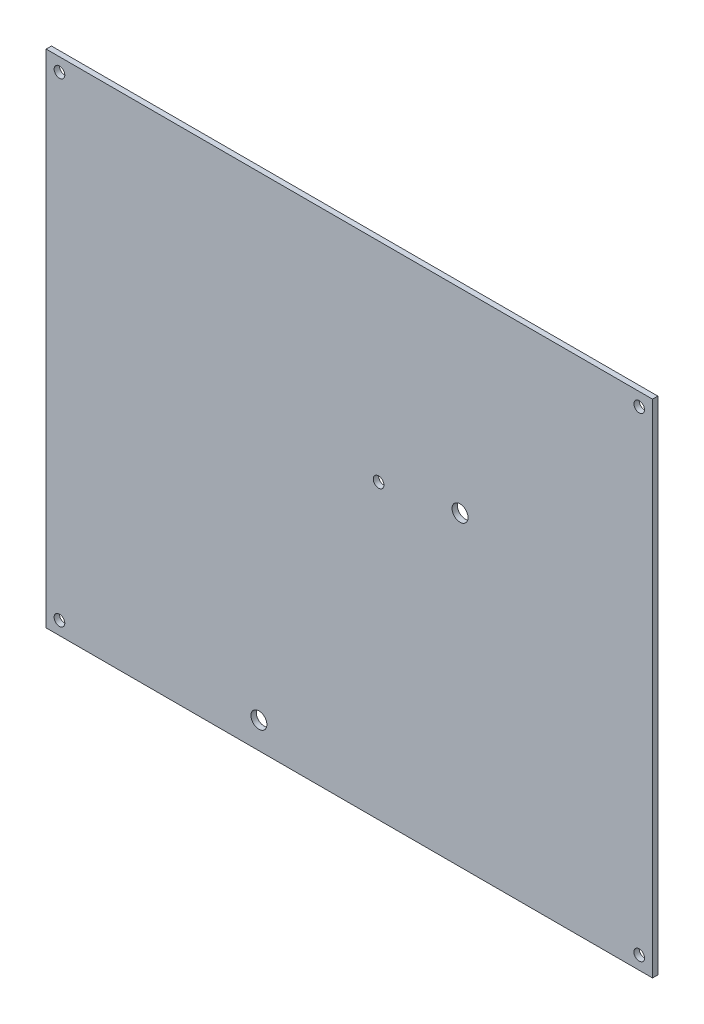
ISO-10303-21;
HEADER;
FILE_DESCRIPTION(('STEP AP214'),'2;1');
FILE_NAME('part.step','',(''),(''),'','','');
FILE_SCHEMA(('AUTOMOTIVE_DESIGN { 1 0 10303 214 1 1 1 1 }'));
ENDSEC;
DATA;
#1=APPLICATION_CONTEXT('core data for automotive mechanical design processes');
#2=APPLICATION_PROTOCOL_DEFINITION('international standard','automotive_design',2000,#1);
#3=PRODUCT_CONTEXT('',#1,'mechanical');
#4=PRODUCT('Part','Part','',(#3));
#5=PRODUCT_RELATED_PRODUCT_CATEGORY('part','',(#4));
#6=PRODUCT_DEFINITION_FORMATION('','',#4);
#7=PRODUCT_DEFINITION_CONTEXT('part definition',#1,'design');
#8=PRODUCT_DEFINITION('design','',#6,#7);
#9=PRODUCT_DEFINITION_SHAPE('','',#8);
#10=(LENGTH_UNIT() NAMED_UNIT(*) SI_UNIT(.MILLI.,.METRE.));
#11=(NAMED_UNIT(*) PLANE_ANGLE_UNIT() SI_UNIT($,.RADIAN.));
#12=(NAMED_UNIT(*) SI_UNIT($,.STERADIAN.) SOLID_ANGLE_UNIT());
#13=UNCERTAINTY_MEASURE_WITH_UNIT(LENGTH_MEASURE(1.E-05),#10,'distance_accuracy_value','');
#14=(GEOMETRIC_REPRESENTATION_CONTEXT(3) GLOBAL_UNCERTAINTY_ASSIGNED_CONTEXT((#13)) GLOBAL_UNIT_ASSIGNED_CONTEXT((#10,
#11,#12)) REPRESENTATION_CONTEXT('',''));
#15=CARTESIAN_POINT('',(0.,0.,0.));
#16=DIRECTION('',(0.,0.,1.));
#17=DIRECTION('',(1.,0.,0.));
#18=AXIS2_PLACEMENT_3D('',#15,#16,#17);
#19=CARTESIAN_POINT('',(30.2454837382941,63.3993055555556,1.));
#20=DIRECTION('',(-1.,0.,0.));
#21=DIRECTION('',(0.,-1.,0.));
#22=AXIS2_PLACEMENT_3D('',#19,#20,#21);
#23=PLANE('',#22);
#24=DIRECTION('',(0.,1.,0.));
#25=VECTOR('',#24,1.);
#26=CARTESIAN_POINT('',(30.2454837382941,63.3993055555556,0.));
#27=LINE('',#26,#25);
#28=CARTESIAN_POINT('',(30.2454837382941,-46.6006944444448,0.));
#29=VERTEX_POINT('',#28);
#30=CARTESIAN_POINT('',(30.2454837382941,47.6493055555556,0.));
#31=VERTEX_POINT('',#30);
#32=EDGE_CURVE('E97',#29,#31,#27,.T.);
#33=ORIENTED_EDGE('',*,*,#32,.T.);
#34=DIRECTION('',(0.,0.,1.));
#35=VECTOR('',#34,1.);
#36=CARTESIAN_POINT('',(30.2454837382941,47.6493055555556,0.));
#37=LINE('',#36,#35);
#38=CARTESIAN_POINT('',(30.2454837382941,47.6493055555556,1.));
#39=VERTEX_POINT('',#38);
#40=EDGE_CURVE('E62',#31,#39,#37,.T.);
#41=ORIENTED_EDGE('',*,*,#40,.T.);
#42=DIRECTION('',(0.,1.,0.));
#43=VECTOR('',#42,1.);
#44=CARTESIAN_POINT('',(30.2454837382941,63.3993055555556,1.));
#45=LINE('',#44,#43);
#46=CARTESIAN_POINT('',(30.2454837382941,-46.6006944444448,1.));
#47=VERTEX_POINT('',#46);
#48=EDGE_CURVE('E92',#47,#39,#45,.T.);
#49=ORIENTED_EDGE('',*,*,#48,.F.);
#50=DIRECTION('',(0.,0.,-1.));
#51=VECTOR('',#50,1.);
#52=CARTESIAN_POINT('',(30.2454837382941,-46.6006944444448,1.));
#53=LINE('',#52,#51);
#54=EDGE_CURVE('E54',#47,#29,#53,.T.);
#55=ORIENTED_EDGE('',*,*,#54,.T.);
#56=EDGE_LOOP('',(#33,#41,#49,#55));
#57=FACE_BOUND('',#56,.T.);
#58=ADVANCED_FACE('F45',(#57),#23,.F.);
#59=CARTESIAN_POINT('',(-83.7545162617059,63.3993055555556,1.));
#60=DIRECTION('',(1.,0.,0.));
#61=DIRECTION('',(0.,1.,0.));
#62=AXIS2_PLACEMENT_3D('',#59,#60,#61);
#63=PLANE('',#62);
#64=DIRECTION('',(0.,-1.,0.));
#65=VECTOR('',#64,1.);
#66=CARTESIAN_POINT('',(-83.7545162617059,63.3993055555556,1.));
#67=LINE('',#66,#65);
#68=CARTESIAN_POINT('',(-83.7545162617059,47.6493055555556,1.));
#69=VERTEX_POINT('',#68);
#70=CARTESIAN_POINT('',(-83.7545162617059,-46.6006944444448,1.));
#71=VERTEX_POINT('',#70);
#72=EDGE_CURVE('E150',#69,#71,#67,.T.);
#73=ORIENTED_EDGE('',*,*,#72,.F.);
#74=DIRECTION('',(0.,0.,1.));
#75=VECTOR('',#74,1.);
#76=CARTESIAN_POINT('',(-83.7545162617059,47.6493055555556,0.));
#77=LINE('',#76,#75);
#78=CARTESIAN_POINT('',(-83.7545162617059,47.6493055555556,0.));
#79=VERTEX_POINT('',#78);
#80=EDGE_CURVE('E163',#79,#69,#77,.T.);
#81=ORIENTED_EDGE('',*,*,#80,.F.);
#82=DIRECTION('',(0.,-1.,0.));
#83=VECTOR('',#82,1.);
#84=CARTESIAN_POINT('',(-83.7545162617059,63.3993055555556,0.));
#85=LINE('',#84,#83);
#86=CARTESIAN_POINT('',(-83.7545162617059,-46.6006944444448,0.));
#87=VERTEX_POINT('',#86);
#88=EDGE_CURVE('E93',#79,#87,#85,.T.);
#89=ORIENTED_EDGE('',*,*,#88,.T.);
#90=DIRECTION('',(0.,0.,-1.));
#91=VECTOR('',#90,1.);
#92=CARTESIAN_POINT('',(-83.7545162617059,-46.6006944444448,1.));
#93=LINE('',#92,#91);
#94=EDGE_CURVE('E11',#71,#87,#93,.T.);
#95=ORIENTED_EDGE('',*,*,#94,.F.);
#96=EDGE_LOOP('',(#73,#81,#89,#95));
#97=FACE_BOUND('',#96,.T.);
#98=ADVANCED_FACE('F161',(#97),#63,.F.);
#99=CARTESIAN_POINT('',(-83.7545162617059,-46.6006944444448,1.));
#100=DIRECTION('',(0.,1.,0.));
#101=DIRECTION('',(0.,0.,1.));
#102=AXIS2_PLACEMENT_3D('',#99,#100,#101);
#103=PLANE('',#102);
#104=DIRECTION('',(1.,0.,0.));
#105=VECTOR('',#104,1.);
#106=CARTESIAN_POINT('',(-83.7545162617059,-46.6006944444448,0.));
#107=LINE('',#106,#105);
#108=EDGE_CURVE('E83',#87,#29,#107,.T.);
#109=ORIENTED_EDGE('',*,*,#108,.T.);
#110=ORIENTED_EDGE('',*,*,#54,.F.);
#111=DIRECTION('',(1.,0.,0.));
#112=VECTOR('',#111,1.);
#113=CARTESIAN_POINT('',(-83.7545162617059,-46.6006944444448,1.));
#114=LINE('',#113,#112);
#115=EDGE_CURVE('E71',#71,#47,#114,.T.);
#116=ORIENTED_EDGE('',*,*,#115,.F.);
#117=ORIENTED_EDGE('',*,*,#94,.T.);
#118=EDGE_LOOP('',(#109,#110,#116,#117));
#119=FACE_BOUND('',#118,.T.);
#120=ADVANCED_FACE('F85',(#119),#103,.F.);
#121=CARTESIAN_POINT('',(0.,0.,1.));
#122=DIRECTION('',(0.,0.,1.));
#123=DIRECTION('',(1.,0.,0.));
#124=AXIS2_PLACEMENT_3D('',#121,#122,#123);
#125=PLANE('',#124);
#126=DIRECTION('',(1.,0.,0.));
#127=VECTOR('',#126,1.);
#128=CARTESIAN_POINT('',(-83.7545162617059,47.6493055555556,1.));
#129=LINE('',#128,#127);
#130=EDGE_CURVE('E158',#69,#39,#129,.T.);
#131=ORIENTED_EDGE('',*,*,#130,.F.);
#132=ORIENTED_EDGE('',*,*,#72,.T.);
#133=ORIENTED_EDGE('',*,*,#115,.T.);
#134=ORIENTED_EDGE('',*,*,#48,.T.);
#135=EDGE_LOOP('',(#131,#132,#133,#134));
#136=FACE_BOUND('',#135,.T.);
#137=CARTESIAN_POINT('',(27.7454837382941,45.1493055555556,1.));
#138=DIRECTION('',(0.,0.,1.));
#139=DIRECTION('',(1.,0.,0.));
#140=AXIS2_PLACEMENT_3D('',#137,#138,#139);
#141=CIRCLE('',#140,1.);
#142=CARTESIAN_POINT('',(28.7454837382941,45.1493055555556,1.));
#143=VERTEX_POINT('',#142);
#144=EDGE_CURVE('E172',#143,#143,#141,.T.);
#145=ORIENTED_EDGE('',*,*,#144,.F.);
#146=EDGE_LOOP('',(#145));
#147=FACE_BOUND('',#146,.T.);
#148=CARTESIAN_POINT('',(-81.2545162617059,45.1493055555556,1.));
#149=DIRECTION('',(0.,0.,1.));
#150=DIRECTION('',(1.,0.,0.));
#151=AXIS2_PLACEMENT_3D('',#148,#149,#150);
#152=CIRCLE('',#151,0.999999999999998);
#153=CARTESIAN_POINT('',(-80.2545162617059,45.1493055555556,1.));
#154=VERTEX_POINT('',#153);
#155=EDGE_CURVE('E181',#154,#154,#152,.T.);
#156=ORIENTED_EDGE('',*,*,#155,.F.);
#157=EDGE_LOOP('',(#156));
#158=FACE_BOUND('',#157,.T.);
#159=CARTESIAN_POINT('',(-5.9445162617059,11.0093055555552,1.));
#160=DIRECTION('',(0.,0.,1.));
#161=DIRECTION('',(1.,0.,0.));
#162=AXIS2_PLACEMENT_3D('',#159,#160,#161);
#163=CIRCLE('',#162,1.5);
#164=CARTESIAN_POINT('',(-4.4445162617059,11.0093055555552,1.));
#165=VERTEX_POINT('',#164);
#166=EDGE_CURVE('E135',#165,#165,#163,.T.);
#167=ORIENTED_EDGE('',*,*,#166,.F.);
#168=EDGE_LOOP('',(#167));
#169=FACE_BOUND('',#168,.T.);
#170=CARTESIAN_POINT('',(-43.7545162617059,-41.6006944444448,1.));
#171=DIRECTION('',(0.,0.,1.));
#172=DIRECTION('',(1.,0.,0.));
#173=AXIS2_PLACEMENT_3D('',#170,#171,#172);
#174=CIRCLE('',#173,1.5);
#175=CARTESIAN_POINT('',(-42.2545162617059,-41.6006944444448,1.));
#176=VERTEX_POINT('',#175);
#177=EDGE_CURVE('E122',#176,#176,#174,.T.);
#178=ORIENTED_EDGE('',*,*,#177,.F.);
#179=EDGE_LOOP('',(#178));
#180=FACE_BOUND('',#179,.T.);
#181=CARTESIAN_POINT('',(-21.2545162617059,8.39930555555517,1.));
#182=DIRECTION('',(0.,0.,1.));
#183=DIRECTION('',(1.,0.,0.));
#184=AXIS2_PLACEMENT_3D('',#181,#182,#183);
#185=CIRCLE('',#184,1.);
#186=CARTESIAN_POINT('',(-20.2545162617059,8.39930555555517,1.));
#187=VERTEX_POINT('',#186);
#188=EDGE_CURVE('E118',#187,#187,#185,.T.);
#189=ORIENTED_EDGE('',*,*,#188,.F.);
#190=EDGE_LOOP('',(#189));
#191=FACE_BOUND('',#190,.T.);
#192=CARTESIAN_POINT('',(-81.2545162617059,-44.1006944444448,1.));
#193=DIRECTION('',(0.,0.,1.));
#194=DIRECTION('',(1.,0.,0.));
#195=AXIS2_PLACEMENT_3D('',#192,#193,#194);
#196=CIRCLE('',#195,0.999999999999998);
#197=CARTESIAN_POINT('',(-80.2545162617059,-44.1006944444448,1.));
#198=VERTEX_POINT('',#197);
#199=EDGE_CURVE('E142',#198,#198,#196,.T.);
#200=ORIENTED_EDGE('',*,*,#199,.F.);
#201=EDGE_LOOP('',(#200));
#202=FACE_BOUND('',#201,.T.);
#203=CARTESIAN_POINT('',(27.7454837382941,-44.1006944444448,1.));
#204=DIRECTION('',(0.,0.,1.));
#205=DIRECTION('',(1.,0.,0.));
#206=AXIS2_PLACEMENT_3D('',#203,#204,#205);
#207=CIRCLE('',#206,1.);
#208=CARTESIAN_POINT('',(28.7454837382941,-44.1006944444448,1.));
#209=VERTEX_POINT('',#208);
#210=EDGE_CURVE('E103',#209,#209,#207,.T.);
#211=ORIENTED_EDGE('',*,*,#210,.F.);
#212=EDGE_LOOP('',(#211));
#213=FACE_BOUND('',#212,.T.);
#214=ADVANCED_FACE('F155',(#136,#147,#158,#169,#180,#191,#202,#213),#125,.T.);
#215=CARTESIAN_POINT('',(0.,0.,0.));
#216=DIRECTION('',(0.,0.,1.));
#217=DIRECTION('',(1.,0.,0.));
#218=AXIS2_PLACEMENT_3D('',#215,#216,#217);
#219=PLANE('',#218);
#220=CARTESIAN_POINT('',(27.7454837382941,45.1493055555556,0.));
#221=DIRECTION('',(0.,0.,1.));
#222=DIRECTION('',(1.,0.,0.));
#223=AXIS2_PLACEMENT_3D('',#220,#221,#222);
#224=CIRCLE('',#223,1.);
#225=CARTESIAN_POINT('',(28.7454837382941,45.1493055555556,0.));
#226=VERTEX_POINT('',#225);
#227=EDGE_CURVE('E177',#226,#226,#224,.T.);
#228=ORIENTED_EDGE('',*,*,#227,.T.);
#229=EDGE_LOOP('',(#228));
#230=FACE_BOUND('',#229,.T.);
#231=CARTESIAN_POINT('',(-81.2545162617059,45.1493055555556,0.));
#232=DIRECTION('',(0.,0.,1.));
#233=DIRECTION('',(1.,0.,0.));
#234=AXIS2_PLACEMENT_3D('',#231,#232,#233);
#235=CIRCLE('',#234,0.999999999999998);
#236=CARTESIAN_POINT('',(-80.2545162617059,45.1493055555556,0.));
#237=VERTEX_POINT('',#236);
#238=EDGE_CURVE('E185',#237,#237,#235,.T.);
#239=ORIENTED_EDGE('',*,*,#238,.T.);
#240=EDGE_LOOP('',(#239));
#241=FACE_BOUND('',#240,.T.);
#242=CARTESIAN_POINT('',(-5.9445162617059,11.0093055555552,0.));
#243=DIRECTION('',(0.,0.,1.));
#244=DIRECTION('',(1.,0.,0.));
#245=AXIS2_PLACEMENT_3D('',#242,#243,#244);
#246=CIRCLE('',#245,1.5);
#247=CARTESIAN_POINT('',(-4.4445162617059,11.0093055555552,0.));
#248=VERTEX_POINT('',#247);
#249=EDGE_CURVE('E48',#248,#248,#246,.T.);
#250=ORIENTED_EDGE('',*,*,#249,.T.);
#251=EDGE_LOOP('',(#250));
#252=FACE_BOUND('',#251,.T.);
#253=CARTESIAN_POINT('',(-43.7545162617059,-41.6006944444448,0.));
#254=DIRECTION('',(0.,0.,1.));
#255=DIRECTION('',(1.,0.,0.));
#256=AXIS2_PLACEMENT_3D('',#253,#254,#255);
#257=CIRCLE('',#256,1.5);
#258=CARTESIAN_POINT('',(-42.2545162617059,-41.6006944444448,0.));
#259=VERTEX_POINT('',#258);
#260=EDGE_CURVE('E119',#259,#259,#257,.T.);
#261=ORIENTED_EDGE('',*,*,#260,.T.);
#262=EDGE_LOOP('',(#261));
#263=FACE_BOUND('',#262,.T.);
#264=CARTESIAN_POINT('',(-21.2545162617059,8.39930555555517,0.));
#265=DIRECTION('',(0.,0.,1.));
#266=DIRECTION('',(1.,0.,0.));
#267=AXIS2_PLACEMENT_3D('',#264,#265,#266);
#268=CIRCLE('',#267,1.);
#269=CARTESIAN_POINT('',(-20.2545162617059,8.39930555555517,0.));
#270=VERTEX_POINT('',#269);
#271=EDGE_CURVE('E114',#270,#270,#268,.T.);
#272=ORIENTED_EDGE('',*,*,#271,.T.);
#273=EDGE_LOOP('',(#272));
#274=FACE_BOUND('',#273,.T.);
#275=CARTESIAN_POINT('',(-81.2545162617059,-44.1006944444448,0.));
#276=DIRECTION('',(0.,0.,1.));
#277=DIRECTION('',(1.,0.,0.));
#278=AXIS2_PLACEMENT_3D('',#275,#276,#277);
#279=CIRCLE('',#278,0.999999999999998);
#280=CARTESIAN_POINT('',(-80.2545162617059,-44.1006944444448,0.));
#281=VERTEX_POINT('',#280);
#282=EDGE_CURVE('E117',#281,#281,#279,.T.);
#283=ORIENTED_EDGE('',*,*,#282,.T.);
#284=EDGE_LOOP('',(#283));
#285=FACE_BOUND('',#284,.T.);
#286=CARTESIAN_POINT('',(27.7454837382941,-44.1006944444448,0.));
#287=DIRECTION('',(0.,0.,1.));
#288=DIRECTION('',(1.,0.,0.));
#289=AXIS2_PLACEMENT_3D('',#286,#287,#288);
#290=CIRCLE('',#289,1.);
#291=CARTESIAN_POINT('',(28.7454837382941,-44.1006944444448,0.));
#292=VERTEX_POINT('',#291);
#293=EDGE_CURVE('E109',#292,#292,#290,.T.);
#294=ORIENTED_EDGE('',*,*,#293,.T.);
#295=EDGE_LOOP('',(#294));
#296=FACE_BOUND('',#295,.T.);
#297=ORIENTED_EDGE('',*,*,#88,.F.);
#298=DIRECTION('',(1.,0.,0.));
#299=VECTOR('',#298,1.);
#300=CARTESIAN_POINT('',(-83.7545162617059,47.6493055555556,0.));
#301=LINE('',#300,#299);
#302=EDGE_CURVE('E101',#79,#31,#301,.T.);
#303=ORIENTED_EDGE('',*,*,#302,.T.);
#304=ORIENTED_EDGE('',*,*,#32,.F.);
#305=ORIENTED_EDGE('',*,*,#108,.F.);
#306=EDGE_LOOP('',(#297,#303,#304,#305));
#307=FACE_BOUND('',#306,.T.);
#308=ADVANCED_FACE('F100',(#230,#241,#252,#263,#274,#285,#296,#307),#219,.F.);
#309=CARTESIAN_POINT('',(27.7454837382941,-44.1006944444448,0.));
#310=DIRECTION('',(0.,0.,1.));
#311=DIRECTION('',(1.,0.,0.));
#312=AXIS2_PLACEMENT_3D('',#309,#310,#311);
#313=CYLINDRICAL_SURFACE('',#312,1.);
#314=ORIENTED_EDGE('',*,*,#293,.F.);
#315=EDGE_LOOP('',(#314));
#316=FACE_BOUND('',#315,.T.);
#317=ORIENTED_EDGE('',*,*,#210,.T.);
#318=EDGE_LOOP('',(#317));
#319=FACE_BOUND('',#318,.T.);
#320=ADVANCED_FACE('F207',(#316,#319),#313,.F.);
#321=CARTESIAN_POINT('',(-81.2545162617059,-44.1006944444448,0.));
#322=DIRECTION('',(0.,0.,1.));
#323=DIRECTION('',(1.,0.,0.));
#324=AXIS2_PLACEMENT_3D('',#321,#322,#323);
#325=CYLINDRICAL_SURFACE('',#324,0.999999999999998);
#326=ORIENTED_EDGE('',*,*,#282,.F.);
#327=EDGE_LOOP('',(#326));
#328=FACE_BOUND('',#327,.T.);
#329=ORIENTED_EDGE('',*,*,#199,.T.);
#330=EDGE_LOOP('',(#329));
#331=FACE_BOUND('',#330,.T.);
#332=ADVANCED_FACE('F209',(#328,#331),#325,.F.);
#333=CARTESIAN_POINT('',(-21.2545162617059,8.39930555555517,-9.));
#334=DIRECTION('',(0.,0.,1.));
#335=DIRECTION('',(1.,0.,0.));
#336=AXIS2_PLACEMENT_3D('',#333,#334,#335);
#337=CYLINDRICAL_SURFACE('',#336,1.);
#338=ORIENTED_EDGE('',*,*,#188,.T.);
#339=EDGE_LOOP('',(#338));
#340=FACE_BOUND('',#339,.T.);
#341=ORIENTED_EDGE('',*,*,#271,.F.);
#342=EDGE_LOOP('',(#341));
#343=FACE_BOUND('',#342,.T.);
#344=ADVANCED_FACE('F216',(#340,#343),#337,.F.);
#345=CARTESIAN_POINT('',(-43.7545162617059,-41.6006944444448,-9.));
#346=DIRECTION('',(0.,0.,1.));
#347=DIRECTION('',(1.,0.,0.));
#348=AXIS2_PLACEMENT_3D('',#345,#346,#347);
#349=CYLINDRICAL_SURFACE('',#348,1.5);
#350=ORIENTED_EDGE('',*,*,#177,.T.);
#351=EDGE_LOOP('',(#350));
#352=FACE_BOUND('',#351,.T.);
#353=ORIENTED_EDGE('',*,*,#260,.F.);
#354=EDGE_LOOP('',(#353));
#355=FACE_BOUND('',#354,.T.);
#356=ADVANCED_FACE('F276',(#352,#355),#349,.F.);
#357=CARTESIAN_POINT('',(-5.9445162617059,11.0093055555552,-9.));
#358=DIRECTION('',(0.,0.,1.));
#359=DIRECTION('',(1.,0.,0.));
#360=AXIS2_PLACEMENT_3D('',#357,#358,#359);
#361=CYLINDRICAL_SURFACE('',#360,1.5);
#362=ORIENTED_EDGE('',*,*,#166,.T.);
#363=EDGE_LOOP('',(#362));
#364=FACE_BOUND('',#363,.T.);
#365=ORIENTED_EDGE('',*,*,#249,.F.);
#366=EDGE_LOOP('',(#365));
#367=FACE_BOUND('',#366,.T.);
#368=ADVANCED_FACE('F268',(#364,#367),#361,.F.);
#369=CARTESIAN_POINT('',(-81.2545162617059,45.1493055555556,0.));
#370=DIRECTION('',(0.,0.,1.));
#371=DIRECTION('',(1.,0.,0.));
#372=AXIS2_PLACEMENT_3D('',#369,#370,#371);
#373=CYLINDRICAL_SURFACE('',#372,0.999999999999998);
#374=ORIENTED_EDGE('',*,*,#238,.F.);
#375=EDGE_LOOP('',(#374));
#376=FACE_BOUND('',#375,.T.);
#377=ORIENTED_EDGE('',*,*,#155,.T.);
#378=EDGE_LOOP('',(#377));
#379=FACE_BOUND('',#378,.T.);
#380=ADVANCED_FACE('F192',(#376,#379),#373,.F.);
#381=CARTESIAN_POINT('',(27.7454837382941,45.1493055555556,0.));
#382=DIRECTION('',(0.,0.,1.));
#383=DIRECTION('',(1.,0.,0.));
#384=AXIS2_PLACEMENT_3D('',#381,#382,#383);
#385=CYLINDRICAL_SURFACE('',#384,1.);
#386=ORIENTED_EDGE('',*,*,#227,.F.);
#387=EDGE_LOOP('',(#386));
#388=FACE_BOUND('',#387,.T.);
#389=ORIENTED_EDGE('',*,*,#144,.T.);
#390=EDGE_LOOP('',(#389));
#391=FACE_BOUND('',#390,.T.);
#392=ADVANCED_FACE('F251',(#388,#391),#385,.F.);
#393=CARTESIAN_POINT('',(-83.7545162617059,47.6493055555556,0.));
#394=DIRECTION('',(0.,-1.,0.));
#395=DIRECTION('',(0.,0.,-1.));
#396=AXIS2_PLACEMENT_3D('',#393,#394,#395);
#397=PLANE('',#396);
#398=ORIENTED_EDGE('',*,*,#130,.T.);
#399=ORIENTED_EDGE('',*,*,#40,.F.);
#400=ORIENTED_EDGE('',*,*,#302,.F.);
#401=ORIENTED_EDGE('',*,*,#80,.T.);
#402=EDGE_LOOP('',(#398,#399,#400,#401));
#403=FACE_BOUND('',#402,.T.);
#404=ADVANCED_FACE('F167',(#403),#397,.F.);
#405=CLOSED_SHELL('',(#58,#98,#120,#214,#308,#320,#332,#344,#356,#368,#380,#392,#404));
#406=MANIFOLD_SOLID_BREP('B2',#405);
#407=ADVANCED_BREP_SHAPE_REPRESENTATION('',(#18,#406),#14);
#408=SHAPE_DEFINITION_REPRESENTATION(#9,#407);
ENDSEC;
END-ISO-10303-21;
